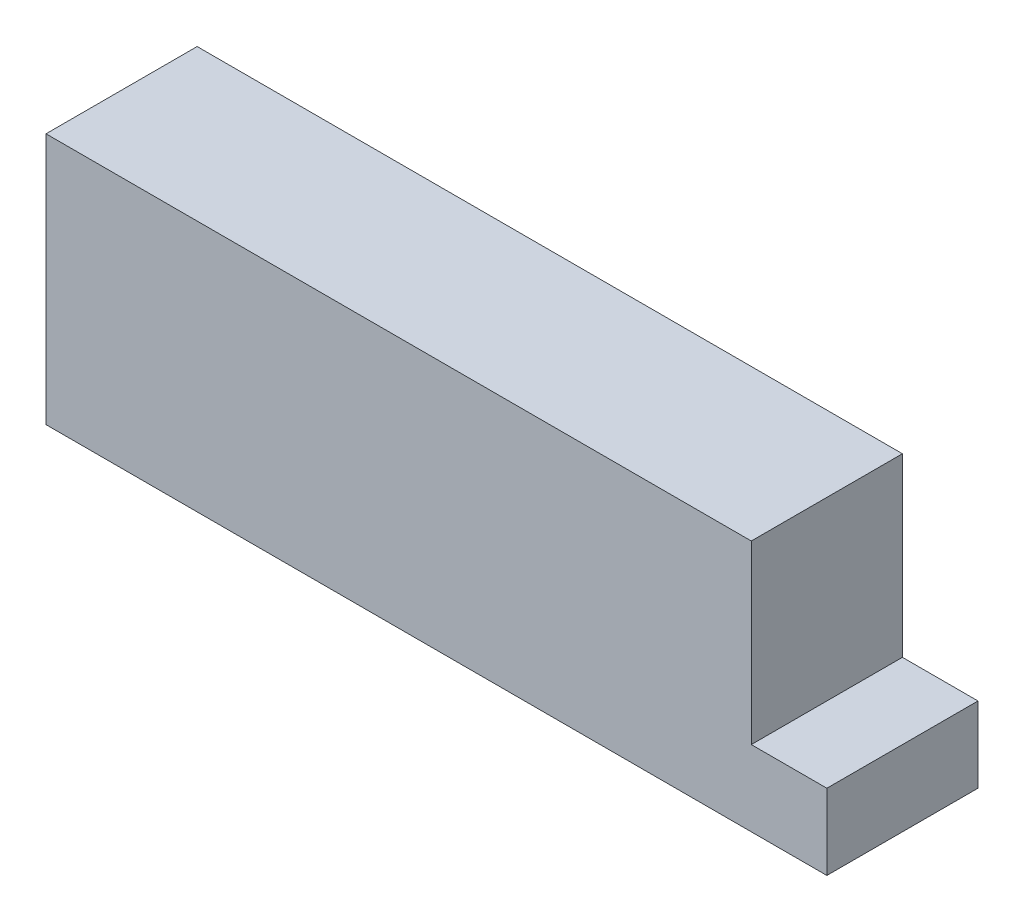
ISO-10303-21;
HEADER;
FILE_DESCRIPTION(('STEP AP214'),'2;1');
FILE_NAME('part.step','',(''),(''),'','','');
FILE_SCHEMA(('AUTOMOTIVE_DESIGN { 1 0 10303 214 1 1 1 1 }'));
ENDSEC;
DATA;
#1=APPLICATION_CONTEXT('core data for automotive mechanical design processes');
#2=APPLICATION_PROTOCOL_DEFINITION('international standard','automotive_design',2000,#1);
#3=PRODUCT_CONTEXT('',#1,'mechanical');
#4=PRODUCT('Part','Part','',(#3));
#5=PRODUCT_RELATED_PRODUCT_CATEGORY('part','',(#4));
#6=PRODUCT_DEFINITION_FORMATION('','',#4);
#7=PRODUCT_DEFINITION_CONTEXT('part definition',#1,'design');
#8=PRODUCT_DEFINITION('design','',#6,#7);
#9=PRODUCT_DEFINITION_SHAPE('','',#8);
#10=(LENGTH_UNIT() NAMED_UNIT(*) SI_UNIT(.MILLI.,.METRE.));
#11=(NAMED_UNIT(*) PLANE_ANGLE_UNIT() SI_UNIT($,.RADIAN.));
#12=(NAMED_UNIT(*) SI_UNIT($,.STERADIAN.) SOLID_ANGLE_UNIT());
#13=UNCERTAINTY_MEASURE_WITH_UNIT(LENGTH_MEASURE(1.E-05),#10,'distance_accuracy_value','');
#14=(GEOMETRIC_REPRESENTATION_CONTEXT(3) GLOBAL_UNCERTAINTY_ASSIGNED_CONTEXT((#13)) GLOBAL_UNIT_ASSIGNED_CONTEXT((#10,
#11,#12)) REPRESENTATION_CONTEXT('',''));
#15=CARTESIAN_POINT('',(0.,0.,0.));
#16=DIRECTION('',(0.,0.,1.));
#17=DIRECTION('',(1.,0.,0.));
#18=AXIS2_PLACEMENT_3D('',#15,#16,#17);
#19=CARTESIAN_POINT('',(76.5261904761905,34.5238095238095,30.));
#20=DIRECTION('',(-1.,0.,0.));
#21=DIRECTION('',(0.,0.,1.));
#22=AXIS2_PLACEMENT_3D('',#19,#20,#21);
#23=PLANE('',#22);
#24=DIRECTION('',(0.,0.,1.));
#25=VECTOR('',#24,1.);
#26=CARTESIAN_POINT('',(76.5261904761905,-0.47619047619047,30.));
#27=LINE('',#26,#25);
#28=CARTESIAN_POINT('',(76.5261904761905,-0.47619047619047,0.));
#29=VERTEX_POINT('',#28);
#30=CARTESIAN_POINT('',(76.5261904761905,-0.47619047619047,30.));
#31=VERTEX_POINT('',#30);
#32=EDGE_CURVE('E50',#29,#31,#27,.T.);
#33=ORIENTED_EDGE('',*,*,#32,.F.);
#34=DIRECTION('',(0.,1.,0.));
#35=VECTOR('',#34,1.);
#36=CARTESIAN_POINT('',(76.5261904761905,34.5238095238095,0.));
#37=LINE('',#36,#35);
#38=CARTESIAN_POINT('',(76.5261904761905,34.5238095238095,0.));
#39=VERTEX_POINT('',#38);
#40=EDGE_CURVE('E139',#29,#39,#37,.T.);
#41=ORIENTED_EDGE('',*,*,#40,.T.);
#42=DIRECTION('',(0.,0.,-1.));
#43=VECTOR('',#42,1.);
#44=CARTESIAN_POINT('',(76.5261904761905,34.5238095238095,30.));
#45=LINE('',#44,#43);
#46=CARTESIAN_POINT('',(76.5261904761905,34.5238095238095,30.));
#47=VERTEX_POINT('',#46);
#48=EDGE_CURVE('E42',#47,#39,#45,.T.);
#49=ORIENTED_EDGE('',*,*,#48,.F.);
#50=DIRECTION('',(0.,1.,0.));
#51=VECTOR('',#50,1.);
#52=CARTESIAN_POINT('',(76.5261904761905,34.5238095238095,30.));
#53=LINE('',#52,#51);
#54=EDGE_CURVE('E102',#31,#47,#53,.T.);
#55=ORIENTED_EDGE('',*,*,#54,.F.);
#56=EDGE_LOOP('',(#33,#41,#49,#55));
#57=FACE_BOUND('',#56,.T.);
#58=ADVANCED_FACE('F33',(#57),#23,.F.);
#59=CARTESIAN_POINT('',(-63.4738095238095,34.5238095238095,30.));
#60=DIRECTION('',(1.,0.,0.));
#61=DIRECTION('',(0.,1.,0.));
#62=AXIS2_PLACEMENT_3D('',#59,#60,#61);
#63=PLANE('',#62);
#64=DIRECTION('',(0.,-1.,0.));
#65=VECTOR('',#64,1.);
#66=CARTESIAN_POINT('',(-63.4738095238095,34.5238095238095,0.));
#67=LINE('',#66,#65);
#68=CARTESIAN_POINT('',(-63.4738095238095,34.5238095238095,0.));
#69=VERTEX_POINT('',#68);
#70=CARTESIAN_POINT('',(-63.4738095238095,-15.4761904761905,0.));
#71=VERTEX_POINT('',#70);
#72=EDGE_CURVE('E132',#69,#71,#67,.T.);
#73=ORIENTED_EDGE('',*,*,#72,.T.);
#74=DIRECTION('',(0.,0.,-1.));
#75=VECTOR('',#74,1.);
#76=CARTESIAN_POINT('',(-63.4738095238095,-15.4761904761905,30.));
#77=LINE('',#76,#75);
#78=CARTESIAN_POINT('',(-63.4738095238095,-15.4761904761905,30.));
#79=VERTEX_POINT('',#78);
#80=EDGE_CURVE('E11',#79,#71,#77,.T.);
#81=ORIENTED_EDGE('',*,*,#80,.F.);
#82=DIRECTION('',(0.,-1.,0.));
#83=VECTOR('',#82,1.);
#84=CARTESIAN_POINT('',(-63.4738095238095,34.5238095238095,30.));
#85=LINE('',#84,#83);
#86=CARTESIAN_POINT('',(-63.4738095238095,34.5238095238095,30.));
#87=VERTEX_POINT('',#86);
#88=EDGE_CURVE('E100',#87,#79,#85,.T.);
#89=ORIENTED_EDGE('',*,*,#88,.F.);
#90=DIRECTION('',(0.,0.,-1.));
#91=VECTOR('',#90,1.);
#92=CARTESIAN_POINT('',(-63.4738095238095,34.5238095238095,30.));
#93=LINE('',#92,#91);
#94=EDGE_CURVE('E147',#87,#69,#93,.T.);
#95=ORIENTED_EDGE('',*,*,#94,.T.);
#96=EDGE_LOOP('',(#73,#81,#89,#95));
#97=FACE_BOUND('',#96,.T.);
#98=ADVANCED_FACE('F35',(#97),#63,.F.);
#99=CARTESIAN_POINT('',(-63.4738095238095,-15.4761904761905,30.));
#100=DIRECTION('',(0.,1.,0.));
#101=DIRECTION('',(0.,0.,1.));
#102=AXIS2_PLACEMENT_3D('',#99,#100,#101);
#103=PLANE('',#102);
#104=DIRECTION('',(1.,0.,0.));
#105=VECTOR('',#104,1.);
#106=CARTESIAN_POINT('',(-63.4738095238095,-15.4761904761905,0.));
#107=LINE('',#106,#105);
#108=CARTESIAN_POINT('',(91.5261904761905,-15.4761904761905,0.));
#109=VERTEX_POINT('',#108);
#110=EDGE_CURVE('E107',#71,#109,#107,.T.);
#111=ORIENTED_EDGE('',*,*,#110,.T.);
#112=DIRECTION('',(0.,0.,-1.));
#113=VECTOR('',#112,1.);
#114=CARTESIAN_POINT('',(91.5261904761905,-15.4761904761905,30.));
#115=LINE('',#114,#113);
#116=CARTESIAN_POINT('',(91.5261904761905,-15.4761904761905,30.));
#117=VERTEX_POINT('',#116);
#118=EDGE_CURVE('E105',#117,#109,#115,.T.);
#119=ORIENTED_EDGE('',*,*,#118,.F.);
#120=DIRECTION('',(1.,0.,0.));
#121=VECTOR('',#120,1.);
#122=CARTESIAN_POINT('',(-63.4738095238095,-15.4761904761905,30.));
#123=LINE('',#122,#121);
#124=EDGE_CURVE('E81',#79,#117,#123,.T.);
#125=ORIENTED_EDGE('',*,*,#124,.F.);
#126=ORIENTED_EDGE('',*,*,#80,.T.);
#127=EDGE_LOOP('',(#111,#119,#125,#126));
#128=FACE_BOUND('',#127,.T.);
#129=ADVANCED_FACE('F106',(#128),#103,.F.);
#130=CARTESIAN_POINT('',(-63.4738095238095,34.5238095238095,30.));
#131=DIRECTION('',(0.,-1.,0.));
#132=DIRECTION('',(0.,0.,-1.));
#133=AXIS2_PLACEMENT_3D('',#130,#131,#132);
#134=PLANE('',#133);
#135=DIRECTION('',(-1.,0.,0.));
#136=VECTOR('',#135,1.);
#137=CARTESIAN_POINT('',(-63.4738095238095,34.5238095238095,0.));
#138=LINE('',#137,#136);
#139=EDGE_CURVE('E75',#39,#69,#138,.T.);
#140=ORIENTED_EDGE('',*,*,#139,.T.);
#141=ORIENTED_EDGE('',*,*,#94,.F.);
#142=DIRECTION('',(-1.,0.,0.));
#143=VECTOR('',#142,1.);
#144=CARTESIAN_POINT('',(-63.4738095238095,34.5238095238095,30.));
#145=LINE('',#144,#143);
#146=EDGE_CURVE('E59',#47,#87,#145,.T.);
#147=ORIENTED_EDGE('',*,*,#146,.F.);
#148=ORIENTED_EDGE('',*,*,#48,.T.);
#149=EDGE_LOOP('',(#140,#141,#147,#148));
#150=FACE_BOUND('',#149,.T.);
#151=ADVANCED_FACE('F149',(#150),#134,.F.);
#152=CARTESIAN_POINT('',(0.,0.,30.));
#153=DIRECTION('',(0.,0.,1.));
#154=DIRECTION('',(1.,0.,0.));
#155=AXIS2_PLACEMENT_3D('',#152,#153,#154);
#156=PLANE('',#155);
#157=ORIENTED_EDGE('',*,*,#88,.T.);
#158=ORIENTED_EDGE('',*,*,#124,.T.);
#159=DIRECTION('',(0.,-1.,0.));
#160=VECTOR('',#159,1.);
#161=CARTESIAN_POINT('',(91.5261904761905,-15.4761904761905,30.));
#162=LINE('',#161,#160);
#163=CARTESIAN_POINT('',(91.5261904761905,-0.47619047619047,30.));
#164=VERTEX_POINT('',#163);
#165=EDGE_CURVE('E98',#164,#117,#162,.T.);
#166=ORIENTED_EDGE('',*,*,#165,.F.);
#167=DIRECTION('',(-1.,0.,0.));
#168=VECTOR('',#167,1.);
#169=CARTESIAN_POINT('',(91.5261904761905,-0.47619047619047,30.));
#170=LINE('',#169,#168);
#171=EDGE_CURVE('E121',#164,#31,#170,.T.);
#172=ORIENTED_EDGE('',*,*,#171,.T.);
#173=ORIENTED_EDGE('',*,*,#54,.T.);
#174=ORIENTED_EDGE('',*,*,#146,.T.);
#175=EDGE_LOOP('',(#157,#158,#166,#172,#173,#174));
#176=FACE_BOUND('',#175,.T.);
#177=ADVANCED_FACE('F95',(#176),#156,.T.);
#178=CARTESIAN_POINT('',(0.,0.,0.));
#179=DIRECTION('',(0.,0.,1.));
#180=DIRECTION('',(1.,0.,0.));
#181=AXIS2_PLACEMENT_3D('',#178,#179,#180);
#182=PLANE('',#181);
#183=ORIENTED_EDGE('',*,*,#72,.F.);
#184=ORIENTED_EDGE('',*,*,#139,.F.);
#185=ORIENTED_EDGE('',*,*,#40,.F.);
#186=DIRECTION('',(-1.,0.,0.));
#187=VECTOR('',#186,1.);
#188=CARTESIAN_POINT('',(91.5261904761905,-0.47619047619047,0.));
#189=LINE('',#188,#187);
#190=CARTESIAN_POINT('',(91.5261904761905,-0.47619047619047,0.));
#191=VERTEX_POINT('',#190);
#192=EDGE_CURVE('E129',#191,#29,#189,.T.);
#193=ORIENTED_EDGE('',*,*,#192,.F.);
#194=DIRECTION('',(0.,1.,0.));
#195=VECTOR('',#194,1.);
#196=CARTESIAN_POINT('',(91.5261904761905,-15.4761904761905,0.));
#197=LINE('',#196,#195);
#198=EDGE_CURVE('E110',#109,#191,#197,.T.);
#199=ORIENTED_EDGE('',*,*,#198,.F.);
#200=ORIENTED_EDGE('',*,*,#110,.F.);
#201=EDGE_LOOP('',(#183,#184,#185,#193,#199,#200));
#202=FACE_BOUND('',#201,.T.);
#203=ADVANCED_FACE('F161',(#202),#182,.F.);
#204=CARTESIAN_POINT('',(91.5261904761905,-0.47619047619047,30.));
#205=DIRECTION('',(0.,-1.,0.));
#206=DIRECTION('',(0.,0.,-1.));
#207=AXIS2_PLACEMENT_3D('',#204,#205,#206);
#208=PLANE('',#207);
#209=ORIENTED_EDGE('',*,*,#32,.T.);
#210=ORIENTED_EDGE('',*,*,#171,.F.);
#211=DIRECTION('',(0.,0.,1.));
#212=VECTOR('',#211,1.);
#213=CARTESIAN_POINT('',(91.5261904761905,-0.47619047619047,30.));
#214=LINE('',#213,#212);
#215=EDGE_CURVE('E114',#191,#164,#214,.T.);
#216=ORIENTED_EDGE('',*,*,#215,.F.);
#217=ORIENTED_EDGE('',*,*,#192,.T.);
#218=EDGE_LOOP('',(#209,#210,#216,#217));
#219=FACE_BOUND('',#218,.T.);
#220=ADVANCED_FACE('F164',(#219),#208,.F.);
#221=CARTESIAN_POINT('',(91.5261904761905,0.,0.));
#222=DIRECTION('',(-1.,0.,0.));
#223=DIRECTION('',(0.,0.,1.));
#224=AXIS2_PLACEMENT_3D('',#221,#222,#223);
#225=PLANE('',#224);
#226=ORIENTED_EDGE('',*,*,#165,.T.);
#227=ORIENTED_EDGE('',*,*,#118,.T.);
#228=ORIENTED_EDGE('',*,*,#198,.T.);
#229=ORIENTED_EDGE('',*,*,#215,.T.);
#230=EDGE_LOOP('',(#226,#227,#228,#229));
#231=FACE_BOUND('',#230,.T.);
#232=ADVANCED_FACE('F112',(#231),#225,.F.);
#233=CLOSED_SHELL('',(#58,#98,#129,#151,#177,#203,#220,#232));
#234=MANIFOLD_SOLID_BREP('B2',#233);
#235=ADVANCED_BREP_SHAPE_REPRESENTATION('',(#18,#234),#14);
#236=SHAPE_DEFINITION_REPRESENTATION(#9,#235);
ENDSEC;
END-ISO-10303-21;
